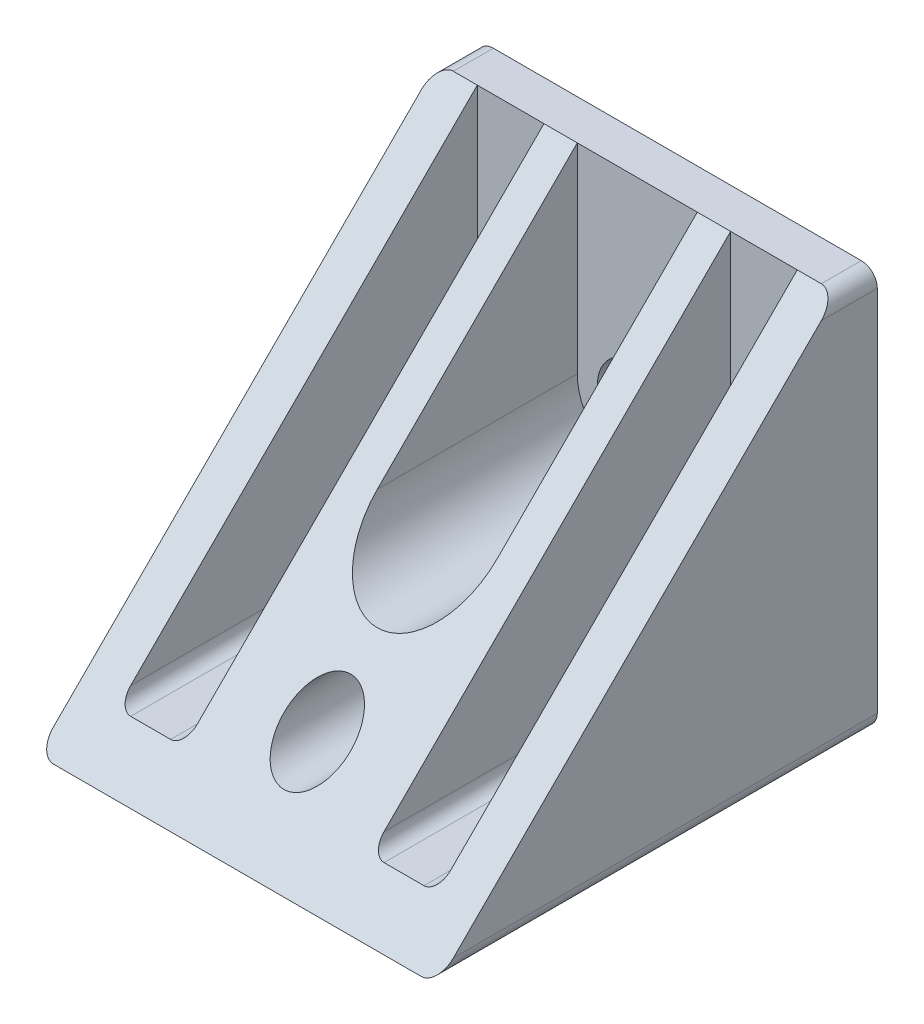
ISO-10303-21;
HEADER;
FILE_DESCRIPTION(('STEP AP214'),'2;1');
FILE_NAME('part.step','',(''),(''),'','','');
FILE_SCHEMA(('AUTOMOTIVE_DESIGN { 1 0 10303 214 1 1 1 1 }'));
ENDSEC;
DATA;
#1=APPLICATION_CONTEXT('core data for automotive mechanical design processes');
#2=APPLICATION_PROTOCOL_DEFINITION('international standard','automotive_design',2000,#1);
#3=PRODUCT_CONTEXT('',#1,'mechanical');
#4=PRODUCT('Part','Part','',(#3));
#5=PRODUCT_RELATED_PRODUCT_CATEGORY('part','',(#4));
#6=PRODUCT_DEFINITION_FORMATION('','',#4);
#7=PRODUCT_DEFINITION_CONTEXT('part definition',#1,'design');
#8=PRODUCT_DEFINITION('design','',#6,#7);
#9=PRODUCT_DEFINITION_SHAPE('','',#8);
#10=(LENGTH_UNIT() NAMED_UNIT(*) SI_UNIT(.MILLI.,.METRE.));
#11=(NAMED_UNIT(*) PLANE_ANGLE_UNIT() SI_UNIT($,.RADIAN.));
#12=(NAMED_UNIT(*) SI_UNIT($,.STERADIAN.) SOLID_ANGLE_UNIT());
#13=UNCERTAINTY_MEASURE_WITH_UNIT(LENGTH_MEASURE(1.E-05),#10,'distance_accuracy_value','');
#14=(GEOMETRIC_REPRESENTATION_CONTEXT(3) GLOBAL_UNCERTAINTY_ASSIGNED_CONTEXT((#13)) GLOBAL_UNIT_ASSIGNED_CONTEXT((#10,
#11,#12)) REPRESENTATION_CONTEXT('',''));
#15=CARTESIAN_POINT('',(0.,0.,0.));
#16=DIRECTION('',(0.,0.,1.));
#17=DIRECTION('',(1.,0.,0.));
#18=AXIS2_PLACEMENT_3D('',#15,#16,#17);
#19=CARTESIAN_POINT('',(30.,30.,3.));
#20=DIRECTION('',(0.,-1.,0.));
#21=DIRECTION('',(0.,0.,-1.));
#22=AXIS2_PLACEMENT_3D('',#19,#20,#21);
#23=PLANE('',#22);
#24=DIRECTION('',(-1.,0.,0.));
#25=VECTOR('',#24,1.);
#26=CARTESIAN_POINT('',(30.,30.,3.));
#27=LINE('',#26,#25);
#28=CARTESIAN_POINT('',(28.8,30.,3.));
#29=VERTEX_POINT('',#28);
#30=CARTESIAN_POINT('',(27.,30.,3.));
#31=VERTEX_POINT('',#30);
#32=EDGE_CURVE('E232',#29,#31,#27,.T.);
#33=ORIENTED_EDGE('',*,*,#32,.F.);
#34=DIRECTION('',(0.,0.,1.));
#35=VECTOR('',#34,1.);
#36=CARTESIAN_POINT('',(28.8,30.,3.));
#37=LINE('',#36,#35);
#38=CARTESIAN_POINT('',(28.8,30.,0.));
#39=VERTEX_POINT('',#38);
#40=EDGE_CURVE('E310',#29,#39,#37,.F.);
#41=ORIENTED_EDGE('',*,*,#40,.T.);
#42=DIRECTION('',(-1.,0.,0.));
#43=VECTOR('',#42,1.);
#44=CARTESIAN_POINT('',(30.,30.,0.));
#45=LINE('',#44,#43);
#46=CARTESIAN_POINT('',(1.2,30.,0.));
#47=VERTEX_POINT('',#46);
#48=EDGE_CURVE('E219',#39,#47,#45,.T.);
#49=ORIENTED_EDGE('',*,*,#48,.T.);
#50=DIRECTION('',(0.,0.,1.));
#51=VECTOR('',#50,1.);
#52=CARTESIAN_POINT('',(1.2,30.,3.));
#53=LINE('',#52,#51);
#54=CARTESIAN_POINT('',(1.2,30.,3.));
#55=VERTEX_POINT('',#54);
#56=EDGE_CURVE('E307',#47,#55,#53,.T.);
#57=ORIENTED_EDGE('',*,*,#56,.T.);
#58=CARTESIAN_POINT('',(3.,30.,3.));
#59=VERTEX_POINT('',#58);
#60=EDGE_CURVE('E231',#59,#55,#27,.T.);
#61=ORIENTED_EDGE('',*,*,#60,.F.);
#62=CARTESIAN_POINT('',(8.,30.,3.));
#63=VERTEX_POINT('',#62);
#64=EDGE_CURVE('E340',#63,#59,#27,.T.);
#65=ORIENTED_EDGE('',*,*,#64,.F.);
#66=CARTESIAN_POINT('',(10.5,30.,3.));
#67=VERTEX_POINT('',#66);
#68=EDGE_CURVE('E342',#67,#63,#27,.T.);
#69=ORIENTED_EDGE('',*,*,#68,.F.);
#70=CARTESIAN_POINT('',(19.5,30.,3.));
#71=VERTEX_POINT('',#70);
#72=EDGE_CURVE('E195',#71,#67,#27,.T.);
#73=ORIENTED_EDGE('',*,*,#72,.F.);
#74=CARTESIAN_POINT('',(22.,30.,3.));
#75=VERTEX_POINT('',#74);
#76=EDGE_CURVE('E347',#75,#71,#27,.T.);
#77=ORIENTED_EDGE('',*,*,#76,.F.);
#78=EDGE_CURVE('E234',#31,#75,#27,.T.);
#79=ORIENTED_EDGE('',*,*,#78,.F.);
#80=EDGE_LOOP('',(#33,#41,#49,#57,#61,#65,#69,#73,#77,#79));
#81=FACE_BOUND('',#80,.T.);
#82=ADVANCED_FACE('F34',(#81),#23,.F.);
#83=CARTESIAN_POINT('',(30.,0.,33.));
#84=DIRECTION('',(0.,-0.707106781186547,-0.707106781186547));
#85=DIRECTION('',(0.,0.707106781186548,-0.707106781186548));
#86=AXIS2_PLACEMENT_3D('',#83,#84,#85);
#87=PLANE('',#86);
#88=CARTESIAN_POINT('',(15.,6.,27.));
#89=DIRECTION('',(0.,-0.707106781186547,-0.707106781186547));
#90=DIRECTION('',(0.,0.707106781186548,-0.707106781186548));
#91=AXIS2_PLACEMENT_3D('',#88,#89,#90);
#92=ELLIPSE('',#91,3.53553390593274,2.5);
#93=CARTESIAN_POINT('',(15.,8.5,24.5));
#94=VERTEX_POINT('',#93);
#95=EDGE_CURVE('E643',#94,#94,#92,.F.);
#96=ORIENTED_EDGE('',*,*,#95,.F.);
#97=EDGE_LOOP('',(#96));
#98=FACE_BOUND('',#97,.T.);
#99=DIRECTION('',(0.,-0.707106781186547,0.707106781186547));
#100=VECTOR('',#99,1.);
#101=CARTESIAN_POINT('',(30.,0.,33.));
#102=LINE('',#101,#100);
#103=CARTESIAN_POINT('',(30.,28.8,4.20000000000001));
#104=VERTEX_POINT('',#103);
#105=CARTESIAN_POINT('',(30.,1.2,31.8));
#106=VERTEX_POINT('',#105);
#107=EDGE_CURVE('E212',#104,#106,#102,.T.);
#108=ORIENTED_EDGE('',*,*,#107,.F.);
#109=CARTESIAN_POINT('',(28.8,28.8,4.20000000000001));
#110=DIRECTION('',(0.,-0.707106781186547,-0.707106781186547));
#111=DIRECTION('',(0.,-0.707106781186548,0.707106781186548));
#112=AXIS2_PLACEMENT_3D('',#109,#110,#111);
#113=ELLIPSE('',#112,1.69705627484771,1.2);
#114=EDGE_CURVE('E305',#104,#29,#113,.F.);
#115=ORIENTED_EDGE('',*,*,#114,.T.);
#116=ORIENTED_EDGE('',*,*,#32,.T.);
#117=DIRECTION('',(0.,-0.707106781186548,0.707106781186548));
#118=VECTOR('',#117,1.);
#119=CARTESIAN_POINT('',(27.,0.,33.));
#120=LINE('',#119,#118);
#121=CARTESIAN_POINT('',(27.,4.,29.));
#122=VERTEX_POINT('',#121);
#123=EDGE_CURVE('E254',#31,#122,#120,.T.);
#124=ORIENTED_EDGE('',*,*,#123,.T.);
#125=CARTESIAN_POINT('',(26.,4.,29.));
#126=DIRECTION('',(0.,-0.707106781186547,-0.707106781186547));
#127=DIRECTION('',(0.,-0.707106781186548,0.707106781186548));
#128=AXIS2_PLACEMENT_3D('',#125,#126,#127);
#129=ELLIPSE('',#128,1.4142135623731,1.);
#130=CARTESIAN_POINT('',(26.,3.,30.));
#131=VERTEX_POINT('',#130);
#132=EDGE_CURVE('E291',#122,#131,#129,.T.);
#133=ORIENTED_EDGE('',*,*,#132,.T.);
#134=DIRECTION('',(-1.,0.,0.));
#135=VECTOR('',#134,1.);
#136=CARTESIAN_POINT('',(30.,3.,30.));
#137=LINE('',#136,#135);
#138=CARTESIAN_POINT('',(23.,3.,30.));
#139=VERTEX_POINT('',#138);
#140=EDGE_CURVE('E249',#131,#139,#137,.T.);
#141=ORIENTED_EDGE('',*,*,#140,.T.);
#142=CARTESIAN_POINT('',(23.,4.,29.));
#143=DIRECTION('',(0.,-0.707106781186547,-0.707106781186547));
#144=DIRECTION('',(0.,-0.707106781186548,0.707106781186548));
#145=AXIS2_PLACEMENT_3D('',#142,#143,#144);
#146=ELLIPSE('',#145,1.4142135623731,1.);
#147=CARTESIAN_POINT('',(22.,4.,29.));
#148=VERTEX_POINT('',#147);
#149=EDGE_CURVE('E289',#139,#148,#146,.T.);
#150=ORIENTED_EDGE('',*,*,#149,.T.);
#151=DIRECTION('',(0.,0.707106781186548,-0.707106781186548));
#152=VECTOR('',#151,1.);
#153=CARTESIAN_POINT('',(22.,0.,33.));
#154=LINE('',#153,#152);
#155=EDGE_CURVE('E252',#148,#75,#154,.T.);
#156=ORIENTED_EDGE('',*,*,#155,.T.);
#157=ORIENTED_EDGE('',*,*,#76,.T.);
#158=DIRECTION('',(0.,-0.707106781186548,0.707106781186548));
#159=VECTOR('',#158,1.);
#160=CARTESIAN_POINT('',(19.5,0.,33.));
#161=LINE('',#160,#159);
#162=CARTESIAN_POINT('',(19.5,15.,18.));
#163=VERTEX_POINT('',#162);
#164=EDGE_CURVE('E238',#71,#163,#161,.T.);
#165=ORIENTED_EDGE('',*,*,#164,.T.);
#166=CARTESIAN_POINT('',(15.,15.,18.));
#167=DIRECTION('',(0.,-0.707106781186547,-0.707106781186547));
#168=DIRECTION('',(0.,0.707106781186548,-0.707106781186548));
#169=AXIS2_PLACEMENT_3D('',#166,#167,#168);
#170=ELLIPSE('',#169,6.36396103067893,4.5);
#171=CARTESIAN_POINT('',(10.5,15.,18.));
#172=VERTEX_POINT('',#171);
#173=EDGE_CURVE('E236',#163,#172,#170,.T.);
#174=ORIENTED_EDGE('',*,*,#173,.T.);
#175=DIRECTION('',(0.,0.707106781186548,-0.707106781186548));
#176=VECTOR('',#175,1.);
#177=CARTESIAN_POINT('',(10.5,0.,33.));
#178=LINE('',#177,#176);
#179=EDGE_CURVE('E183',#172,#67,#178,.T.);
#180=ORIENTED_EDGE('',*,*,#179,.T.);
#181=ORIENTED_EDGE('',*,*,#68,.T.);
#182=DIRECTION('',(0.,-0.707106781186548,0.707106781186548));
#183=VECTOR('',#182,1.);
#184=CARTESIAN_POINT('',(8.,0.,33.));
#185=LINE('',#184,#183);
#186=CARTESIAN_POINT('',(8.,4.,29.));
#187=VERTEX_POINT('',#186);
#188=EDGE_CURVE('E246',#63,#187,#185,.T.);
#189=ORIENTED_EDGE('',*,*,#188,.T.);
#190=CARTESIAN_POINT('',(7.,4.,29.));
#191=DIRECTION('',(0.,-0.707106781186547,-0.707106781186547));
#192=DIRECTION('',(0.,-0.707106781186548,0.707106781186548));
#193=AXIS2_PLACEMENT_3D('',#190,#191,#192);
#194=ELLIPSE('',#193,1.4142135623731,1.);
#195=CARTESIAN_POINT('',(7.,3.,30.));
#196=VERTEX_POINT('',#195);
#197=EDGE_CURVE('E285',#187,#196,#194,.T.);
#198=ORIENTED_EDGE('',*,*,#197,.T.);
#199=DIRECTION('',(-1.,0.,0.));
#200=VECTOR('',#199,1.);
#201=CARTESIAN_POINT('',(30.,3.,30.));
#202=LINE('',#201,#200);
#203=CARTESIAN_POINT('',(4.,3.,30.));
#204=VERTEX_POINT('',#203);
#205=EDGE_CURVE('E241',#196,#204,#202,.T.);
#206=ORIENTED_EDGE('',*,*,#205,.T.);
#207=CARTESIAN_POINT('',(4.,4.,29.));
#208=DIRECTION('',(0.,-0.707106781186547,-0.707106781186547));
#209=DIRECTION('',(0.,-0.707106781186548,0.707106781186548));
#210=AXIS2_PLACEMENT_3D('',#207,#208,#209);
#211=ELLIPSE('',#210,1.4142135623731,1.);
#212=CARTESIAN_POINT('',(3.,4.,29.));
#213=VERTEX_POINT('',#212);
#214=EDGE_CURVE('E287',#204,#213,#211,.T.);
#215=ORIENTED_EDGE('',*,*,#214,.T.);
#216=DIRECTION('',(0.,0.707106781186548,-0.707106781186548));
#217=VECTOR('',#216,1.);
#218=CARTESIAN_POINT('',(3.,0.,33.));
#219=LINE('',#218,#217);
#220=EDGE_CURVE('E244',#213,#59,#219,.T.);
#221=ORIENTED_EDGE('',*,*,#220,.T.);
#222=ORIENTED_EDGE('',*,*,#60,.T.);
#223=CARTESIAN_POINT('',(1.2,28.8,4.20000000000001));
#224=DIRECTION('',(0.,-0.707106781186547,-0.707106781186547));
#225=DIRECTION('',(0.,0.707106781186548,-0.707106781186548));
#226=AXIS2_PLACEMENT_3D('',#223,#224,#225);
#227=ELLIPSE('',#226,1.69705627484771,1.2);
#228=CARTESIAN_POINT('',(0.,28.8,4.20000000000001));
#229=VERTEX_POINT('',#228);
#230=EDGE_CURVE('E299',#55,#229,#227,.F.);
#231=ORIENTED_EDGE('',*,*,#230,.T.);
#232=DIRECTION('',(0.,-0.707106781186547,0.707106781186547));
#233=VECTOR('',#232,1.);
#234=CARTESIAN_POINT('',(0.,0.,33.));
#235=LINE('',#234,#233);
#236=CARTESIAN_POINT('',(0.,1.2,31.8));
#237=VERTEX_POINT('',#236);
#238=EDGE_CURVE('E210',#229,#237,#235,.T.);
#239=ORIENTED_EDGE('',*,*,#238,.T.);
#240=CARTESIAN_POINT('',(1.2,1.2,31.8));
#241=DIRECTION('',(0.,-0.707106781186547,-0.707106781186547));
#242=DIRECTION('',(0.,-0.707106781186548,0.707106781186548));
#243=AXIS2_PLACEMENT_3D('',#240,#241,#242);
#244=ELLIPSE('',#243,1.69705627484771,1.2);
#245=CARTESIAN_POINT('',(1.2,0.,33.));
#246=VERTEX_POINT('',#245);
#247=EDGE_CURVE('E301',#237,#246,#244,.F.);
#248=ORIENTED_EDGE('',*,*,#247,.T.);
#249=DIRECTION('',(-1.,0.,0.));
#250=VECTOR('',#249,1.);
#251=CARTESIAN_POINT('',(30.,0.,33.));
#252=LINE('',#251,#250);
#253=CARTESIAN_POINT('',(28.8,0.,33.));
#254=VERTEX_POINT('',#253);
#255=EDGE_CURVE('E228',#254,#246,#252,.T.);
#256=ORIENTED_EDGE('',*,*,#255,.F.);
#257=CARTESIAN_POINT('',(28.8,1.2,31.8));
#258=DIRECTION('',(0.,-0.707106781186547,-0.707106781186547));
#259=DIRECTION('',(0.,0.707106781186548,-0.707106781186548));
#260=AXIS2_PLACEMENT_3D('',#257,#258,#259);
#261=ELLIPSE('',#260,1.69705627484771,1.2);
#262=EDGE_CURVE('E303',#254,#106,#261,.F.);
#263=ORIENTED_EDGE('',*,*,#262,.T.);
#264=EDGE_LOOP('',(#108,#115,#116,#124,#133,#141,#150,#156,#157,#165,#174,#180,#181,#189,#198,
#206,#215,#221,#222,#231,#239,#248,#256,#263));
#265=FACE_BOUND('',#264,.T.);
#266=ADVANCED_FACE('F338',(#98,#265),#87,.F.);
#267=CARTESIAN_POINT('',(30.,0.,0.));
#268=DIRECTION('',(0.,1.,0.));
#269=DIRECTION('',(0.,0.,1.));
#270=AXIS2_PLACEMENT_3D('',#267,#268,#269);
#271=PLANE('',#270);
#272=DIRECTION('',(-1.,0.,0.));
#273=VECTOR('',#272,1.);
#274=CARTESIAN_POINT('',(30.,0.,0.));
#275=LINE('',#274,#273);
#276=CARTESIAN_POINT('',(28.8,0.,0.));
#277=VERTEX_POINT('',#276);
#278=CARTESIAN_POINT('',(1.2,0.,0.));
#279=VERTEX_POINT('',#278);
#280=EDGE_CURVE('E226',#277,#279,#275,.T.);
#281=ORIENTED_EDGE('',*,*,#280,.F.);
#282=DIRECTION('',(0.,0.,-1.));
#283=VECTOR('',#282,1.);
#284=CARTESIAN_POINT('',(28.8,0.,0.));
#285=LINE('',#284,#283);
#286=EDGE_CURVE('E320',#277,#254,#285,.F.);
#287=ORIENTED_EDGE('',*,*,#286,.T.);
#288=ORIENTED_EDGE('',*,*,#255,.T.);
#289=DIRECTION('',(0.,0.,-1.));
#290=VECTOR('',#289,1.);
#291=CARTESIAN_POINT('',(1.2,0.,0.));
#292=LINE('',#291,#290);
#293=EDGE_CURVE('E318',#246,#279,#292,.T.);
#294=ORIENTED_EDGE('',*,*,#293,.T.);
#295=EDGE_LOOP('',(#281,#287,#288,#294));
#296=FACE_BOUND('',#295,.T.);
#297=ADVANCED_FACE('F374',(#296),#271,.F.);
#298=CARTESIAN_POINT('',(30.,30.,0.));
#299=DIRECTION('',(0.,0.,1.));
#300=DIRECTION('',(0.,-1.,0.));
#301=AXIS2_PLACEMENT_3D('',#298,#299,#300);
#302=PLANE('',#301);
#303=CARTESIAN_POINT('',(15.,6.,0.));
#304=DIRECTION('',(0.,0.,1.));
#305=DIRECTION('',(1.,0.,0.));
#306=AXIS2_PLACEMENT_3D('',#303,#304,#305);
#307=CIRCLE('',#306,2.5);
#308=CARTESIAN_POINT('',(17.5,6.,0.));
#309=VERTEX_POINT('',#308);
#310=EDGE_CURVE('E633',#309,#309,#307,.T.);
#311=ORIENTED_EDGE('',*,*,#310,.T.);
#312=EDGE_LOOP('',(#311));
#313=FACE_BOUND('',#312,.T.);
#314=CARTESIAN_POINT('',(15.,15.,0.));
#315=DIRECTION('',(0.,0.,1.));
#316=DIRECTION('',(0.,-1.,0.));
#317=AXIS2_PLACEMENT_3D('',#314,#315,#316);
#318=CIRCLE('',#317,3.);
#319=CARTESIAN_POINT('',(15.,12.,0.));
#320=VERTEX_POINT('',#319);
#321=EDGE_CURVE('E636',#320,#320,#318,.T.);
#322=ORIENTED_EDGE('',*,*,#321,.T.);
#323=EDGE_LOOP('',(#322));
#324=FACE_BOUND('',#323,.T.);
#325=ORIENTED_EDGE('',*,*,#48,.F.);
#326=CARTESIAN_POINT('',(28.8,28.8,0.));
#327=DIRECTION('',(0.,0.,1.));
#328=DIRECTION('',(0.,-1.,0.));
#329=AXIS2_PLACEMENT_3D('',#326,#327,#328);
#330=CIRCLE('',#329,1.2);
#331=CARTESIAN_POINT('',(30.,28.8,0.));
#332=VERTEX_POINT('',#331);
#333=EDGE_CURVE('E316',#39,#332,#330,.F.);
#334=ORIENTED_EDGE('',*,*,#333,.T.);
#335=DIRECTION('',(0.,1.,0.));
#336=VECTOR('',#335,1.);
#337=CARTESIAN_POINT('',(30.,30.,0.));
#338=LINE('',#337,#336);
#339=CARTESIAN_POINT('',(30.,1.2,0.));
#340=VERTEX_POINT('',#339);
#341=EDGE_CURVE('E215',#340,#332,#338,.T.);
#342=ORIENTED_EDGE('',*,*,#341,.F.);
#343=CARTESIAN_POINT('',(28.8,1.2,0.));
#344=DIRECTION('',(0.,0.,1.));
#345=DIRECTION('',(0.,-1.,0.));
#346=AXIS2_PLACEMENT_3D('',#343,#344,#345);
#347=CIRCLE('',#346,1.2);
#348=EDGE_CURVE('E57',#340,#277,#347,.F.);
#349=ORIENTED_EDGE('',*,*,#348,.T.);
#350=ORIENTED_EDGE('',*,*,#280,.T.);
#351=CARTESIAN_POINT('',(1.2,1.2,0.));
#352=DIRECTION('',(0.,0.,1.));
#353=DIRECTION('',(0.,-1.,0.));
#354=AXIS2_PLACEMENT_3D('',#351,#352,#353);
#355=CIRCLE('',#354,1.2);
#356=CARTESIAN_POINT('',(0.,1.2,0.));
#357=VERTEX_POINT('',#356);
#358=EDGE_CURVE('E49',#279,#357,#355,.F.);
#359=ORIENTED_EDGE('',*,*,#358,.T.);
#360=DIRECTION('',(0.,1.,0.));
#361=VECTOR('',#360,1.);
#362=CARTESIAN_POINT('',(0.,30.,0.));
#363=LINE('',#362,#361);
#364=CARTESIAN_POINT('',(0.,28.8,0.));
#365=VERTEX_POINT('',#364);
#366=EDGE_CURVE('E216',#357,#365,#363,.T.);
#367=ORIENTED_EDGE('',*,*,#366,.T.);
#368=CARTESIAN_POINT('',(1.2,28.8,0.));
#369=DIRECTION('',(0.,0.,1.));
#370=DIRECTION('',(0.,-1.,0.));
#371=AXIS2_PLACEMENT_3D('',#368,#369,#370);
#372=CIRCLE('',#371,1.2);
#373=EDGE_CURVE('E312',#365,#47,#372,.F.);
#374=ORIENTED_EDGE('',*,*,#373,.T.);
#375=EDGE_LOOP('',(#325,#334,#342,#349,#350,#359,#367,#374));
#376=FACE_BOUND('',#375,.T.);
#377=ADVANCED_FACE('F329',(#313,#324,#376),#302,.F.);
#378=CARTESIAN_POINT('',(30.,0.,0.));
#379=DIRECTION('',(-1.,0.,0.));
#380=DIRECTION('',(0.,0.,1.));
#381=AXIS2_PLACEMENT_3D('',#378,#379,#380);
#382=PLANE('',#381);
#383=ORIENTED_EDGE('',*,*,#341,.T.);
#384=DIRECTION('',(0.,0.,1.));
#385=VECTOR('',#384,1.);
#386=CARTESIAN_POINT('',(30.,28.8,0.));
#387=LINE('',#386,#385);
#388=EDGE_CURVE('E296',#332,#104,#387,.T.);
#389=ORIENTED_EDGE('',*,*,#388,.T.);
#390=ORIENTED_EDGE('',*,*,#107,.T.);
#391=DIRECTION('',(0.,0.,-1.));
#392=VECTOR('',#391,1.);
#393=CARTESIAN_POINT('',(30.,1.2,0.));
#394=LINE('',#393,#392);
#395=EDGE_CURVE('E293',#106,#340,#394,.T.);
#396=ORIENTED_EDGE('',*,*,#395,.T.);
#397=EDGE_LOOP('',(#383,#389,#390,#396));
#398=FACE_BOUND('',#397,.T.);
#399=ADVANCED_FACE('F366',(#398),#382,.F.);
#400=CARTESIAN_POINT('',(0.,0.,0.));
#401=DIRECTION('',(-1.,0.,0.));
#402=DIRECTION('',(0.,0.,1.));
#403=AXIS2_PLACEMENT_3D('',#400,#401,#402);
#404=PLANE('',#403);
#405=ORIENTED_EDGE('',*,*,#366,.F.);
#406=DIRECTION('',(0.,0.,-1.));
#407=VECTOR('',#406,1.);
#408=CARTESIAN_POINT('',(0.,1.2,33.));
#409=LINE('',#408,#407);
#410=EDGE_CURVE('E11',#357,#237,#409,.F.);
#411=ORIENTED_EDGE('',*,*,#410,.T.);
#412=ORIENTED_EDGE('',*,*,#238,.F.);
#413=DIRECTION('',(0.,0.,1.));
#414=VECTOR('',#413,1.);
#415=CARTESIAN_POINT('',(0.,28.8,0.));
#416=LINE('',#415,#414);
#417=EDGE_CURVE('E42',#229,#365,#416,.F.);
#418=ORIENTED_EDGE('',*,*,#417,.T.);
#419=EDGE_LOOP('',(#405,#411,#412,#418));
#420=FACE_BOUND('',#419,.T.);
#421=ADVANCED_FACE('F325',(#420),#404,.T.);
#422=CARTESIAN_POINT('',(15.,15.,48.));
#423=DIRECTION('',(0.,0.,-1.));
#424=DIRECTION('',(-1.,0.,0.));
#425=AXIS2_PLACEMENT_3D('',#422,#423,#424);
#426=CYLINDRICAL_SURFACE('',#425,4.5);
#427=DIRECTION('',(0.,0.,-1.));
#428=VECTOR('',#427,1.);
#429=CARTESIAN_POINT('',(19.5,15.,48.));
#430=LINE('',#429,#428);
#431=CARTESIAN_POINT('',(19.5,15.,3.));
#432=VERTEX_POINT('',#431);
#433=EDGE_CURVE('E187',#163,#432,#430,.T.);
#434=ORIENTED_EDGE('',*,*,#433,.T.);
#435=CARTESIAN_POINT('',(15.,15.,3.));
#436=DIRECTION('',(0.,0.,-1.));
#437=DIRECTION('',(-1.,0.,0.));
#438=AXIS2_PLACEMENT_3D('',#435,#436,#437);
#439=CIRCLE('',#438,4.5);
#440=CARTESIAN_POINT('',(10.5,15.,3.));
#441=VERTEX_POINT('',#440);
#442=EDGE_CURVE('E193',#432,#441,#439,.T.);
#443=ORIENTED_EDGE('',*,*,#442,.T.);
#444=DIRECTION('',(0.,0.,-1.));
#445=VECTOR('',#444,1.);
#446=CARTESIAN_POINT('',(10.5,15.,48.));
#447=LINE('',#446,#445);
#448=EDGE_CURVE('E178',#172,#441,#447,.T.);
#449=ORIENTED_EDGE('',*,*,#448,.F.);
#450=ORIENTED_EDGE('',*,*,#173,.F.);
#451=EDGE_LOOP('',(#434,#443,#449,#450));
#452=FACE_BOUND('',#451,.T.);
#453=ADVANCED_FACE('F197',(#452),#426,.F.);
#454=CARTESIAN_POINT('',(19.5,15.,48.));
#455=DIRECTION('',(1.,0.,0.));
#456=DIRECTION('',(0.,1.,0.));
#457=AXIS2_PLACEMENT_3D('',#454,#455,#456);
#458=PLANE('',#457);
#459=DIRECTION('',(0.,-1.,0.));
#460=VECTOR('',#459,1.);
#461=CARTESIAN_POINT('',(19.5,15.,3.));
#462=LINE('',#461,#460);
#463=EDGE_CURVE('E188',#71,#432,#462,.T.);
#464=ORIENTED_EDGE('',*,*,#463,.T.);
#465=ORIENTED_EDGE('',*,*,#433,.F.);
#466=ORIENTED_EDGE('',*,*,#164,.F.);
#467=EDGE_LOOP('',(#464,#465,#466));
#468=FACE_BOUND('',#467,.T.);
#469=ADVANCED_FACE('F456',(#468),#458,.F.);
#470=CARTESIAN_POINT('',(10.5,15.,48.));
#471=DIRECTION('',(-1.,0.,0.));
#472=DIRECTION('',(0.,-1.,0.));
#473=AXIS2_PLACEMENT_3D('',#470,#471,#472);
#474=PLANE('',#473);
#475=ORIENTED_EDGE('',*,*,#448,.T.);
#476=DIRECTION('',(0.,1.,0.));
#477=VECTOR('',#476,1.);
#478=CARTESIAN_POINT('',(10.5,15.,3.));
#479=LINE('',#478,#477);
#480=EDGE_CURVE('E181',#441,#67,#479,.T.);
#481=ORIENTED_EDGE('',*,*,#480,.T.);
#482=ORIENTED_EDGE('',*,*,#179,.F.);
#483=EDGE_LOOP('',(#475,#481,#482));
#484=FACE_BOUND('',#483,.T.);
#485=ADVANCED_FACE('F180',(#484),#474,.F.);
#486=CARTESIAN_POINT('',(15.,15.,3.));
#487=DIRECTION('',(0.,0.,-1.));
#488=DIRECTION('',(-1.,0.,0.));
#489=AXIS2_PLACEMENT_3D('',#486,#487,#488);
#490=PLANE('',#489);
#491=CARTESIAN_POINT('',(15.,15.,3.));
#492=DIRECTION('',(0.,0.,1.));
#493=DIRECTION('',(1.,0.,0.));
#494=AXIS2_PLACEMENT_3D('',#491,#492,#493);
#495=CIRCLE('',#494,3.);
#496=CARTESIAN_POINT('',(18.,15.,3.));
#497=VERTEX_POINT('',#496);
#498=EDGE_CURVE('E638',#497,#497,#495,.T.);
#499=ORIENTED_EDGE('',*,*,#498,.F.);
#500=EDGE_LOOP('',(#499));
#501=FACE_BOUND('',#500,.T.);
#502=ORIENTED_EDGE('',*,*,#480,.F.);
#503=ORIENTED_EDGE('',*,*,#442,.F.);
#504=ORIENTED_EDGE('',*,*,#463,.F.);
#505=ORIENTED_EDGE('',*,*,#72,.T.);
#506=EDGE_LOOP('',(#502,#503,#504,#505));
#507=FACE_BOUND('',#506,.T.);
#508=ADVANCED_FACE('F192',(#501,#507),#490,.F.);
#509=CARTESIAN_POINT('',(8.,57.,48.));
#510=DIRECTION('',(1.,0.,0.));
#511=DIRECTION('',(0.,0.,-1.));
#512=AXIS2_PLACEMENT_3D('',#509,#510,#511);
#513=PLANE('',#512);
#514=DIRECTION('',(0.,-1.,0.));
#515=VECTOR('',#514,1.);
#516=CARTESIAN_POINT('',(8.,57.,3.));
#517=LINE('',#516,#515);
#518=CARTESIAN_POINT('',(8.,4.,3.));
#519=VERTEX_POINT('',#518);
#520=EDGE_CURVE('E647',#63,#519,#517,.T.);
#521=ORIENTED_EDGE('',*,*,#520,.T.);
#522=DIRECTION('',(0.,0.,-1.));
#523=VECTOR('',#522,1.);
#524=CARTESIAN_POINT('',(8.,4.,30.));
#525=LINE('',#524,#523);
#526=EDGE_CURVE('E266',#519,#187,#525,.F.);
#527=ORIENTED_EDGE('',*,*,#526,.T.);
#528=ORIENTED_EDGE('',*,*,#188,.F.);
#529=EDGE_LOOP('',(#521,#527,#528));
#530=FACE_BOUND('',#529,.T.);
#531=ADVANCED_FACE('F432',(#530),#513,.F.);
#532=CARTESIAN_POINT('',(3.,57.,48.));
#533=DIRECTION('',(-1.,0.,0.));
#534=DIRECTION('',(0.,0.,1.));
#535=AXIS2_PLACEMENT_3D('',#532,#533,#534);
#536=PLANE('',#535);
#537=ORIENTED_EDGE('',*,*,#220,.F.);
#538=DIRECTION('',(0.,0.,-1.));
#539=VECTOR('',#538,1.);
#540=CARTESIAN_POINT('',(3.,4.,3.));
#541=LINE('',#540,#539);
#542=CARTESIAN_POINT('',(3.,4.,3.));
#543=VERTEX_POINT('',#542);
#544=EDGE_CURVE('E268',#213,#543,#541,.T.);
#545=ORIENTED_EDGE('',*,*,#544,.T.);
#546=DIRECTION('',(0.,1.,0.));
#547=VECTOR('',#546,1.);
#548=CARTESIAN_POINT('',(3.,57.,3.));
#549=LINE('',#548,#547);
#550=EDGE_CURVE('E200',#543,#59,#549,.T.);
#551=ORIENTED_EDGE('',*,*,#550,.T.);
#552=EDGE_LOOP('',(#537,#545,#551));
#553=FACE_BOUND('',#552,.T.);
#554=ADVANCED_FACE('F429',(#553),#536,.F.);
#555=CARTESIAN_POINT('',(3.,3.,48.));
#556=DIRECTION('',(0.,-1.,0.));
#557=DIRECTION('',(0.,0.,-1.));
#558=AXIS2_PLACEMENT_3D('',#555,#556,#557);
#559=PLANE('',#558);
#560=ORIENTED_EDGE('',*,*,#205,.F.);
#561=DIRECTION('',(0.,0.,-1.));
#562=VECTOR('',#561,1.);
#563=CARTESIAN_POINT('',(7.,3.,3.));
#564=LINE('',#563,#562);
#565=CARTESIAN_POINT('',(7.,3.,3.));
#566=VERTEX_POINT('',#565);
#567=EDGE_CURVE('E259',#196,#566,#564,.T.);
#568=ORIENTED_EDGE('',*,*,#567,.T.);
#569=DIRECTION('',(-1.,0.,0.));
#570=VECTOR('',#569,1.);
#571=CARTESIAN_POINT('',(3.,3.,3.));
#572=LINE('',#571,#570);
#573=CARTESIAN_POINT('',(4.,3.,3.));
#574=VERTEX_POINT('',#573);
#575=EDGE_CURVE('E203',#566,#574,#572,.T.);
#576=ORIENTED_EDGE('',*,*,#575,.T.);
#577=DIRECTION('',(0.,0.,-1.));
#578=VECTOR('',#577,1.);
#579=CARTESIAN_POINT('',(4.,3.,30.));
#580=LINE('',#579,#578);
#581=EDGE_CURVE('E257',#574,#204,#580,.F.);
#582=ORIENTED_EDGE('',*,*,#581,.T.);
#583=EDGE_LOOP('',(#560,#568,#576,#582));
#584=FACE_BOUND('',#583,.T.);
#585=ADVANCED_FACE('F428',(#584),#559,.F.);
#586=CARTESIAN_POINT('',(0.,0.,3.));
#587=DIRECTION('',(0.,0.,1.));
#588=DIRECTION('',(1.,0.,0.));
#589=AXIS2_PLACEMENT_3D('',#586,#587,#588);
#590=PLANE('',#589);
#591=ORIENTED_EDGE('',*,*,#575,.F.);
#592=CARTESIAN_POINT('',(7.,4.,3.));
#593=DIRECTION('',(0.,0.,1.));
#594=DIRECTION('',(1.,0.,0.));
#595=AXIS2_PLACEMENT_3D('',#592,#593,#594);
#596=CIRCLE('',#595,1.);
#597=EDGE_CURVE('E264',#566,#519,#596,.T.);
#598=ORIENTED_EDGE('',*,*,#597,.T.);
#599=ORIENTED_EDGE('',*,*,#520,.F.);
#600=ORIENTED_EDGE('',*,*,#64,.T.);
#601=ORIENTED_EDGE('',*,*,#550,.F.);
#602=CARTESIAN_POINT('',(4.,4.,3.));
#603=DIRECTION('',(0.,0.,1.));
#604=DIRECTION('',(1.,0.,0.));
#605=AXIS2_PLACEMENT_3D('',#602,#603,#604);
#606=CIRCLE('',#605,1.);
#607=EDGE_CURVE('E262',#543,#574,#606,.T.);
#608=ORIENTED_EDGE('',*,*,#607,.T.);
#609=EDGE_LOOP('',(#591,#598,#599,#600,#601,#608));
#610=FACE_BOUND('',#609,.T.);
#611=ADVANCED_FACE('F424',(#610),#590,.T.);
#612=CARTESIAN_POINT('',(27.,57.,48.));
#613=DIRECTION('',(1.,0.,0.));
#614=DIRECTION('',(0.,0.,-1.));
#615=AXIS2_PLACEMENT_3D('',#612,#613,#614);
#616=PLANE('',#615);
#617=DIRECTION('',(0.,-1.,0.));
#618=VECTOR('',#617,1.);
#619=CARTESIAN_POINT('',(27.,57.,3.));
#620=LINE('',#619,#618);
#621=CARTESIAN_POINT('',(27.,4.,3.));
#622=VERTEX_POINT('',#621);
#623=EDGE_CURVE('E358',#31,#622,#620,.T.);
#624=ORIENTED_EDGE('',*,*,#623,.T.);
#625=DIRECTION('',(0.,0.,-1.));
#626=VECTOR('',#625,1.);
#627=CARTESIAN_POINT('',(27.,4.,30.));
#628=LINE('',#627,#626);
#629=EDGE_CURVE('E283',#622,#122,#628,.F.);
#630=ORIENTED_EDGE('',*,*,#629,.T.);
#631=ORIENTED_EDGE('',*,*,#123,.F.);
#632=EDGE_LOOP('',(#624,#630,#631));
#633=FACE_BOUND('',#632,.T.);
#634=ADVANCED_FACE('F427',(#633),#616,.F.);
#635=CARTESIAN_POINT('',(22.,57.,48.));
#636=DIRECTION('',(-1.,0.,0.));
#637=DIRECTION('',(0.,0.,1.));
#638=AXIS2_PLACEMENT_3D('',#635,#636,#637);
#639=PLANE('',#638);
#640=ORIENTED_EDGE('',*,*,#155,.F.);
#641=DIRECTION('',(0.,0.,-1.));
#642=VECTOR('',#641,1.);
#643=CARTESIAN_POINT('',(22.,4.,3.));
#644=LINE('',#643,#642);
#645=CARTESIAN_POINT('',(22.,4.,3.));
#646=VERTEX_POINT('',#645);
#647=EDGE_CURVE('E271',#148,#646,#644,.T.);
#648=ORIENTED_EDGE('',*,*,#647,.T.);
#649=DIRECTION('',(0.,1.,0.));
#650=VECTOR('',#649,1.);
#651=CARTESIAN_POINT('',(22.,57.,3.));
#652=LINE('',#651,#650);
#653=EDGE_CURVE('E206',#646,#75,#652,.T.);
#654=ORIENTED_EDGE('',*,*,#653,.T.);
#655=EDGE_LOOP('',(#640,#648,#654));
#656=FACE_BOUND('',#655,.T.);
#657=ADVANCED_FACE('F443',(#656),#639,.F.);
#658=CARTESIAN_POINT('',(22.,3.,48.));
#659=DIRECTION('',(0.,-1.,0.));
#660=DIRECTION('',(0.,0.,-1.));
#661=AXIS2_PLACEMENT_3D('',#658,#659,#660);
#662=PLANE('',#661);
#663=DIRECTION('',(-1.,0.,0.));
#664=VECTOR('',#663,1.);
#665=CARTESIAN_POINT('',(22.,3.,3.));
#666=LINE('',#665,#664);
#667=CARTESIAN_POINT('',(26.,3.,3.));
#668=VERTEX_POINT('',#667);
#669=CARTESIAN_POINT('',(23.,3.,3.));
#670=VERTEX_POINT('',#669);
#671=EDGE_CURVE('E640',#668,#670,#666,.T.);
#672=ORIENTED_EDGE('',*,*,#671,.T.);
#673=DIRECTION('',(0.,0.,-1.));
#674=VECTOR('',#673,1.);
#675=CARTESIAN_POINT('',(23.,3.,30.));
#676=LINE('',#675,#674);
#677=EDGE_CURVE('E281',#670,#139,#676,.F.);
#678=ORIENTED_EDGE('',*,*,#677,.T.);
#679=ORIENTED_EDGE('',*,*,#140,.F.);
#680=DIRECTION('',(0.,0.,-1.));
#681=VECTOR('',#680,1.);
#682=CARTESIAN_POINT('',(26.,3.,3.));
#683=LINE('',#682,#681);
#684=EDGE_CURVE('E278',#131,#668,#683,.T.);
#685=ORIENTED_EDGE('',*,*,#684,.T.);
#686=EDGE_LOOP('',(#672,#678,#679,#685));
#687=FACE_BOUND('',#686,.T.);
#688=ADVANCED_FACE('F442',(#687),#662,.F.);
#689=CARTESIAN_POINT('',(0.,0.,3.));
#690=DIRECTION('',(0.,0.,1.));
#691=DIRECTION('',(1.,0.,0.));
#692=AXIS2_PLACEMENT_3D('',#689,#690,#691);
#693=PLANE('',#692);
#694=ORIENTED_EDGE('',*,*,#653,.F.);
#695=CARTESIAN_POINT('',(23.,4.,3.));
#696=DIRECTION('',(0.,0.,1.));
#697=DIRECTION('',(1.,0.,0.));
#698=AXIS2_PLACEMENT_3D('',#695,#696,#697);
#699=CIRCLE('',#698,1.);
#700=EDGE_CURVE('E276',#646,#670,#699,.T.);
#701=ORIENTED_EDGE('',*,*,#700,.T.);
#702=ORIENTED_EDGE('',*,*,#671,.F.);
#703=CARTESIAN_POINT('',(26.,4.,3.));
#704=DIRECTION('',(0.,0.,1.));
#705=DIRECTION('',(1.,0.,0.));
#706=AXIS2_PLACEMENT_3D('',#703,#704,#705);
#707=CIRCLE('',#706,1.);
#708=EDGE_CURVE('E274',#668,#622,#707,.T.);
#709=ORIENTED_EDGE('',*,*,#708,.T.);
#710=ORIENTED_EDGE('',*,*,#623,.F.);
#711=ORIENTED_EDGE('',*,*,#78,.T.);
#712=EDGE_LOOP('',(#694,#701,#702,#709,#710,#711));
#713=FACE_BOUND('',#712,.T.);
#714=ADVANCED_FACE('F355',(#713),#693,.T.);
#715=CARTESIAN_POINT('',(7.,4.,48.));
#716=DIRECTION('',(0.,0.,1.));
#717=DIRECTION('',(1.,0.,0.));
#718=AXIS2_PLACEMENT_3D('',#715,#716,#717);
#719=CYLINDRICAL_SURFACE('',#718,1.);
#720=ORIENTED_EDGE('',*,*,#197,.F.);
#721=ORIENTED_EDGE('',*,*,#526,.F.);
#722=ORIENTED_EDGE('',*,*,#597,.F.);
#723=ORIENTED_EDGE('',*,*,#567,.F.);
#724=EDGE_LOOP('',(#720,#721,#722,#723));
#725=FACE_BOUND('',#724,.T.);
#726=ADVANCED_FACE('F392',(#725),#719,.F.);
#727=CARTESIAN_POINT('',(4.,4.,48.));
#728=DIRECTION('',(0.,0.,1.));
#729=DIRECTION('',(1.,0.,0.));
#730=AXIS2_PLACEMENT_3D('',#727,#728,#729);
#731=CYLINDRICAL_SURFACE('',#730,1.);
#732=ORIENTED_EDGE('',*,*,#214,.F.);
#733=ORIENTED_EDGE('',*,*,#581,.F.);
#734=ORIENTED_EDGE('',*,*,#607,.F.);
#735=ORIENTED_EDGE('',*,*,#544,.F.);
#736=EDGE_LOOP('',(#732,#733,#734,#735));
#737=FACE_BOUND('',#736,.T.);
#738=ADVANCED_FACE('F395',(#737),#731,.F.);
#739=CARTESIAN_POINT('',(23.,4.,48.));
#740=DIRECTION('',(0.,0.,1.));
#741=DIRECTION('',(1.,0.,0.));
#742=AXIS2_PLACEMENT_3D('',#739,#740,#741);
#743=CYLINDRICAL_SURFACE('',#742,1.);
#744=ORIENTED_EDGE('',*,*,#149,.F.);
#745=ORIENTED_EDGE('',*,*,#677,.F.);
#746=ORIENTED_EDGE('',*,*,#700,.F.);
#747=ORIENTED_EDGE('',*,*,#647,.F.);
#748=EDGE_LOOP('',(#744,#745,#746,#747));
#749=FACE_BOUND('',#748,.T.);
#750=ADVANCED_FACE('F399',(#749),#743,.F.);
#751=CARTESIAN_POINT('',(26.,4.,48.));
#752=DIRECTION('',(0.,0.,1.));
#753=DIRECTION('',(1.,0.,0.));
#754=AXIS2_PLACEMENT_3D('',#751,#752,#753);
#755=CYLINDRICAL_SURFACE('',#754,1.);
#756=ORIENTED_EDGE('',*,*,#132,.F.);
#757=ORIENTED_EDGE('',*,*,#629,.F.);
#758=ORIENTED_EDGE('',*,*,#708,.F.);
#759=ORIENTED_EDGE('',*,*,#684,.F.);
#760=EDGE_LOOP('',(#756,#757,#758,#759));
#761=FACE_BOUND('',#760,.T.);
#762=ADVANCED_FACE('F403',(#761),#755,.F.);
#763=CARTESIAN_POINT('',(15.,15.,-42.));
#764=DIRECTION('',(0.,0.,1.));
#765=DIRECTION('',(1.,0.,0.));
#766=AXIS2_PLACEMENT_3D('',#763,#764,#765);
#767=CYLINDRICAL_SURFACE('',#766,3.);
#768=ORIENTED_EDGE('',*,*,#498,.T.);
#769=EDGE_LOOP('',(#768));
#770=FACE_BOUND('',#769,.T.);
#771=ORIENTED_EDGE('',*,*,#321,.F.);
#772=EDGE_LOOP('',(#771));
#773=FACE_BOUND('',#772,.T.);
#774=ADVANCED_FACE('F407',(#770,#773),#767,.F.);
#775=CARTESIAN_POINT('',(15.,6.,92.));
#776=DIRECTION('',(0.,0.,-1.));
#777=DIRECTION('',(-1.,0.,0.));
#778=AXIS2_PLACEMENT_3D('',#775,#776,#777);
#779=CYLINDRICAL_SURFACE('',#778,2.5);
#780=ORIENTED_EDGE('',*,*,#310,.F.);
#781=EDGE_LOOP('',(#780));
#782=FACE_BOUND('',#781,.T.);
#783=ORIENTED_EDGE('',*,*,#95,.T.);
#784=EDGE_LOOP('',(#783));
#785=FACE_BOUND('',#784,.T.);
#786=ADVANCED_FACE('F410',(#782,#785),#779,.F.);
#787=CARTESIAN_POINT('',(28.8,28.8,0.));
#788=DIRECTION('',(0.,0.,1.));
#789=DIRECTION('',(1.,0.,0.));
#790=AXIS2_PLACEMENT_3D('',#787,#788,#789);
#791=CYLINDRICAL_SURFACE('',#790,1.2);
#792=ORIENTED_EDGE('',*,*,#333,.F.);
#793=ORIENTED_EDGE('',*,*,#40,.F.);
#794=ORIENTED_EDGE('',*,*,#114,.F.);
#795=ORIENTED_EDGE('',*,*,#388,.F.);
#796=EDGE_LOOP('',(#792,#793,#794,#795));
#797=FACE_BOUND('',#796,.T.);
#798=ADVANCED_FACE('F363',(#797),#791,.T.);
#799=CARTESIAN_POINT('',(28.8,1.2,0.));
#800=DIRECTION('',(0.,0.,-1.));
#801=DIRECTION('',(-1.,0.,0.));
#802=AXIS2_PLACEMENT_3D('',#799,#800,#801);
#803=CYLINDRICAL_SURFACE('',#802,1.2);
#804=ORIENTED_EDGE('',*,*,#262,.F.);
#805=ORIENTED_EDGE('',*,*,#286,.F.);
#806=ORIENTED_EDGE('',*,*,#348,.F.);
#807=ORIENTED_EDGE('',*,*,#395,.F.);
#808=EDGE_LOOP('',(#804,#805,#806,#807));
#809=FACE_BOUND('',#808,.T.);
#810=ADVANCED_FACE('F370',(#809),#803,.T.);
#811=CARTESIAN_POINT('',(1.2,1.2,0.));
#812=DIRECTION('',(0.,0.,1.));
#813=DIRECTION('',(1.,0.,0.));
#814=AXIS2_PLACEMENT_3D('',#811,#812,#813);
#815=CYLINDRICAL_SURFACE('',#814,1.2);
#816=ORIENTED_EDGE('',*,*,#247,.F.);
#817=ORIENTED_EDGE('',*,*,#410,.F.);
#818=ORIENTED_EDGE('',*,*,#358,.F.);
#819=ORIENTED_EDGE('',*,*,#293,.F.);
#820=EDGE_LOOP('',(#816,#817,#818,#819));
#821=FACE_BOUND('',#820,.T.);
#822=ADVANCED_FACE('F376',(#821),#815,.T.);
#823=CARTESIAN_POINT('',(1.2,28.8,3.));
#824=DIRECTION('',(0.,0.,-1.));
#825=DIRECTION('',(-1.,0.,0.));
#826=AXIS2_PLACEMENT_3D('',#823,#824,#825);
#827=CYLINDRICAL_SURFACE('',#826,1.2);
#828=ORIENTED_EDGE('',*,*,#373,.F.);
#829=ORIENTED_EDGE('',*,*,#417,.F.);
#830=ORIENTED_EDGE('',*,*,#230,.F.);
#831=ORIENTED_EDGE('',*,*,#56,.F.);
#832=EDGE_LOOP('',(#828,#829,#830,#831));
#833=FACE_BOUND('',#832,.T.);
#834=ADVANCED_FACE('F36',(#833),#827,.T.);
#835=CLOSED_SHELL('',(#82,#266,#297,#377,#399,#421,#453,#469,#485,#508,#531,#554,#585,#611,#634,
#657,#688,#714,#726,#738,#750,#762,#774,#786,#798,#810,#822,#834));
#836=MANIFOLD_SOLID_BREP('B2',#835);
#837=ADVANCED_BREP_SHAPE_REPRESENTATION('',(#18,#836),#14);
#838=SHAPE_DEFINITION_REPRESENTATION(#9,#837);
ENDSEC;
END-ISO-10303-21;
